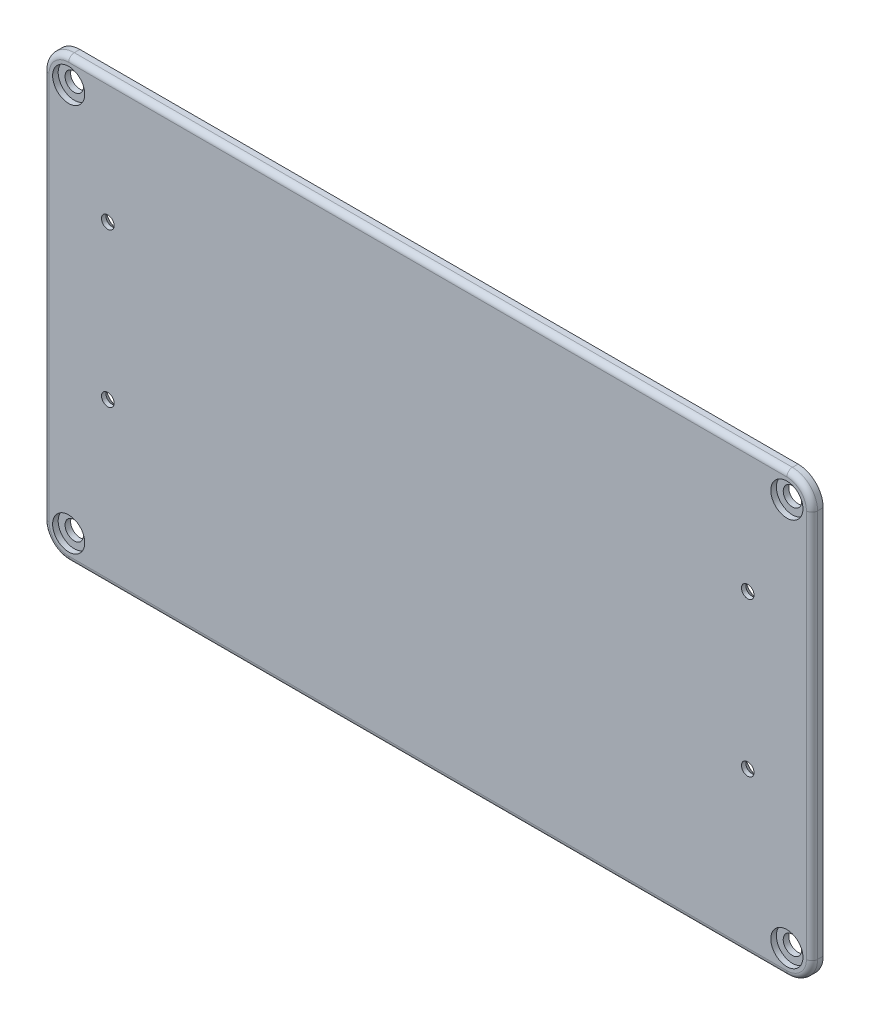
ISO-10303-21;
HEADER;
FILE_DESCRIPTION(('STEP AP214'),'2;1');
FILE_NAME('part.step','',(''),(''),'','','');
FILE_SCHEMA(('AUTOMOTIVE_DESIGN { 1 0 10303 214 1 1 1 1 }'));
ENDSEC;
DATA;
#1=APPLICATION_CONTEXT('core data for automotive mechanical design processes');
#2=APPLICATION_PROTOCOL_DEFINITION('international standard','automotive_design',2000,#1);
#3=PRODUCT_CONTEXT('',#1,'mechanical');
#4=PRODUCT('Part','Part','',(#3));
#5=PRODUCT_RELATED_PRODUCT_CATEGORY('part','',(#4));
#6=PRODUCT_DEFINITION_FORMATION('','',#4);
#7=PRODUCT_DEFINITION_CONTEXT('part definition',#1,'design');
#8=PRODUCT_DEFINITION('design','',#6,#7);
#9=PRODUCT_DEFINITION_SHAPE('','',#8);
#10=(LENGTH_UNIT() NAMED_UNIT(*) SI_UNIT(.MILLI.,.METRE.));
#11=(NAMED_UNIT(*) PLANE_ANGLE_UNIT() SI_UNIT($,.RADIAN.));
#12=(NAMED_UNIT(*) SI_UNIT($,.STERADIAN.) SOLID_ANGLE_UNIT());
#13=UNCERTAINTY_MEASURE_WITH_UNIT(LENGTH_MEASURE(1.E-05),#10,'distance_accuracy_value','');
#14=(GEOMETRIC_REPRESENTATION_CONTEXT(3) GLOBAL_UNCERTAINTY_ASSIGNED_CONTEXT((#13)) GLOBAL_UNIT_ASSIGNED_CONTEXT((#10,
#11,#12)) REPRESENTATION_CONTEXT('',''));
#15=CARTESIAN_POINT('',(0.,0.,0.));
#16=DIRECTION('',(0.,0.,1.));
#17=DIRECTION('',(1.,0.,0.));
#18=AXIS2_PLACEMENT_3D('',#15,#16,#17);
#19=CARTESIAN_POINT('',(-137.5,78.5,4.));
#20=DIRECTION('',(0.,-1.,0.));
#21=DIRECTION('',(0.,0.,-1.));
#22=AXIS2_PLACEMENT_3D('',#19,#20,#21);
#23=PLANE('',#22);
#24=DIRECTION('',(0.,0.,-1.));
#25=VECTOR('',#24,1.);
#26=CARTESIAN_POINT('',(-128.5,78.5,4.));
#27=LINE('',#26,#25);
#28=CARTESIAN_POINT('',(-128.5,78.5,0.));
#29=VERTEX_POINT('',#28);
#30=CARTESIAN_POINT('',(-128.5,78.5,2.));
#31=VERTEX_POINT('',#30);
#32=EDGE_CURVE('E141',#29,#31,#27,.F.);
#33=ORIENTED_EDGE('',*,*,#32,.T.);
#34=DIRECTION('',(-1.,0.,0.));
#35=VECTOR('',#34,1.);
#36=CARTESIAN_POINT('',(-137.5,78.5,2.));
#37=LINE('',#36,#35);
#38=CARTESIAN_POINT('',(128.5,78.5,2.));
#39=VERTEX_POINT('',#38);
#40=EDGE_CURVE('E137',#31,#39,#37,.F.);
#41=ORIENTED_EDGE('',*,*,#40,.T.);
#42=DIRECTION('',(0.,0.,-1.));
#43=VECTOR('',#42,1.);
#44=CARTESIAN_POINT('',(128.5,78.5,4.));
#45=LINE('',#44,#43);
#46=CARTESIAN_POINT('',(128.5,78.5,0.));
#47=VERTEX_POINT('',#46);
#48=EDGE_CURVE('E130',#39,#47,#45,.T.);
#49=ORIENTED_EDGE('',*,*,#48,.T.);
#50=DIRECTION('',(-1.,0.,0.));
#51=VECTOR('',#50,1.);
#52=CARTESIAN_POINT('',(-137.5,78.5,0.));
#53=LINE('',#52,#51);
#54=EDGE_CURVE('E134',#47,#29,#53,.T.);
#55=ORIENTED_EDGE('',*,*,#54,.T.);
#56=EDGE_LOOP('',(#33,#41,#49,#55));
#57=FACE_BOUND('',#56,.T.);
#58=ADVANCED_FACE('F39',(#57),#23,.F.);
#59=CARTESIAN_POINT('',(-137.5,78.5,4.));
#60=DIRECTION('',(1.,0.,0.));
#61=DIRECTION('',(0.,0.,-1.));
#62=AXIS2_PLACEMENT_3D('',#59,#60,#61);
#63=PLANE('',#62);
#64=DIRECTION('',(0.,0.,-1.));
#65=VECTOR('',#64,1.);
#66=CARTESIAN_POINT('',(-137.5,-69.5,4.));
#67=LINE('',#66,#65);
#68=CARTESIAN_POINT('',(-137.5,-69.5,0.));
#69=VERTEX_POINT('',#68);
#70=CARTESIAN_POINT('',(-137.5,-69.5,2.));
#71=VERTEX_POINT('',#70);
#72=EDGE_CURVE('E182',#69,#71,#67,.F.);
#73=ORIENTED_EDGE('',*,*,#72,.T.);
#74=DIRECTION('',(0.,-1.,0.));
#75=VECTOR('',#74,1.);
#76=CARTESIAN_POINT('',(-137.5,78.5,2.));
#77=LINE('',#76,#75);
#78=CARTESIAN_POINT('',(-137.5,69.5,2.));
#79=VERTEX_POINT('',#78);
#80=EDGE_CURVE('E207',#71,#79,#77,.F.);
#81=ORIENTED_EDGE('',*,*,#80,.T.);
#82=DIRECTION('',(0.,0.,-1.));
#83=VECTOR('',#82,1.);
#84=CARTESIAN_POINT('',(-137.5,69.5,4.));
#85=LINE('',#84,#83);
#86=CARTESIAN_POINT('',(-137.5,69.5,0.));
#87=VERTEX_POINT('',#86);
#88=EDGE_CURVE('E185',#79,#87,#85,.T.);
#89=ORIENTED_EDGE('',*,*,#88,.T.);
#90=DIRECTION('',(0.,-1.,0.));
#91=VECTOR('',#90,1.);
#92=CARTESIAN_POINT('',(-137.5,78.5,0.));
#93=LINE('',#92,#91);
#94=EDGE_CURVE('E157',#87,#69,#93,.T.);
#95=ORIENTED_EDGE('',*,*,#94,.T.);
#96=EDGE_LOOP('',(#73,#81,#89,#95));
#97=FACE_BOUND('',#96,.T.);
#98=ADVANCED_FACE('F349',(#97),#63,.F.);
#99=CARTESIAN_POINT('',(-137.5,-78.5,4.));
#100=DIRECTION('',(0.,1.,0.));
#101=DIRECTION('',(0.,0.,1.));
#102=AXIS2_PLACEMENT_3D('',#99,#100,#101);
#103=PLANE('',#102);
#104=DIRECTION('',(0.,0.,-1.));
#105=VECTOR('',#104,1.);
#106=CARTESIAN_POINT('',(128.5,-78.5,4.));
#107=LINE('',#106,#105);
#108=CARTESIAN_POINT('',(128.5,-78.5,0.));
#109=VERTEX_POINT('',#108);
#110=CARTESIAN_POINT('',(128.5,-78.5,2.));
#111=VERTEX_POINT('',#110);
#112=EDGE_CURVE('E180',#109,#111,#107,.F.);
#113=ORIENTED_EDGE('',*,*,#112,.T.);
#114=DIRECTION('',(1.,0.,0.));
#115=VECTOR('',#114,1.);
#116=CARTESIAN_POINT('',(-137.5,-78.5,2.));
#117=LINE('',#116,#115);
#118=CARTESIAN_POINT('',(-128.5,-78.5,2.));
#119=VERTEX_POINT('',#118);
#120=EDGE_CURVE('E11',#111,#119,#117,.F.);
#121=ORIENTED_EDGE('',*,*,#120,.T.);
#122=DIRECTION('',(0.,0.,-1.));
#123=VECTOR('',#122,1.);
#124=CARTESIAN_POINT('',(-128.5,-78.5,4.));
#125=LINE('',#124,#123);
#126=CARTESIAN_POINT('',(-128.5,-78.5,0.));
#127=VERTEX_POINT('',#126);
#128=EDGE_CURVE('E178',#119,#127,#125,.T.);
#129=ORIENTED_EDGE('',*,*,#128,.T.);
#130=DIRECTION('',(1.,0.,0.));
#131=VECTOR('',#130,1.);
#132=CARTESIAN_POINT('',(-137.5,-78.5,0.));
#133=LINE('',#132,#131);
#134=EDGE_CURVE('E161',#127,#109,#133,.T.);
#135=ORIENTED_EDGE('',*,*,#134,.T.);
#136=EDGE_LOOP('',(#113,#121,#129,#135));
#137=FACE_BOUND('',#136,.T.);
#138=ADVANCED_FACE('F354',(#137),#103,.F.);
#139=CARTESIAN_POINT('',(137.5,78.5,4.));
#140=DIRECTION('',(-1.,0.,0.));
#141=DIRECTION('',(0.,0.,1.));
#142=AXIS2_PLACEMENT_3D('',#139,#140,#141);
#143=PLANE('',#142);
#144=DIRECTION('',(0.,0.,-1.));
#145=VECTOR('',#144,1.);
#146=CARTESIAN_POINT('',(137.5,69.5,4.));
#147=LINE('',#146,#145);
#148=CARTESIAN_POINT('',(137.5,69.5,0.));
#149=VERTEX_POINT('',#148);
#150=CARTESIAN_POINT('',(137.5,69.5,2.));
#151=VERTEX_POINT('',#150);
#152=EDGE_CURVE('E146',#149,#151,#147,.F.);
#153=ORIENTED_EDGE('',*,*,#152,.T.);
#154=DIRECTION('',(0.,1.,0.));
#155=VECTOR('',#154,1.);
#156=CARTESIAN_POINT('',(137.5,78.5,2.));
#157=LINE('',#156,#155);
#158=CARTESIAN_POINT('',(137.5,-69.5,2.));
#159=VERTEX_POINT('',#158);
#160=EDGE_CURVE('E63',#151,#159,#157,.F.);
#161=ORIENTED_EDGE('',*,*,#160,.T.);
#162=DIRECTION('',(0.,0.,-1.));
#163=VECTOR('',#162,1.);
#164=CARTESIAN_POINT('',(137.5,-69.5,4.));
#165=LINE('',#164,#163);
#166=CARTESIAN_POINT('',(137.5,-69.5,0.));
#167=VERTEX_POINT('',#166);
#168=EDGE_CURVE('E150',#159,#167,#165,.T.);
#169=ORIENTED_EDGE('',*,*,#168,.T.);
#170=DIRECTION('',(0.,1.,0.));
#171=VECTOR('',#170,1.);
#172=CARTESIAN_POINT('',(137.5,78.5,0.));
#173=LINE('',#172,#171);
#174=EDGE_CURVE('E170',#167,#149,#173,.T.);
#175=ORIENTED_EDGE('',*,*,#174,.T.);
#176=EDGE_LOOP('',(#153,#161,#169,#175));
#177=FACE_BOUND('',#176,.T.);
#178=ADVANCED_FACE('F344',(#177),#143,.F.);
#179=CARTESIAN_POINT('',(0.,0.,4.));
#180=DIRECTION('',(0.,0.,-1.));
#181=DIRECTION('',(-1.,0.,0.));
#182=AXIS2_PLACEMENT_3D('',#179,#180,#181);
#183=PLANE('',#182);
#184=DIRECTION('',(0.,-1.,0.));
#185=VECTOR('',#184,1.);
#186=CARTESIAN_POINT('',(-135.5,0.,4.));
#187=LINE('',#186,#185);
#188=CARTESIAN_POINT('',(-135.5,69.5,4.));
#189=VERTEX_POINT('',#188);
#190=CARTESIAN_POINT('',(-135.5,-69.5,4.));
#191=VERTEX_POINT('',#190);
#192=EDGE_CURVE('E199',#189,#191,#187,.T.);
#193=ORIENTED_EDGE('',*,*,#192,.T.);
#194=CARTESIAN_POINT('',(-128.5,-69.5,4.));
#195=DIRECTION('',(0.,0.,-1.));
#196=DIRECTION('',(-1.,0.,0.));
#197=AXIS2_PLACEMENT_3D('',#194,#195,#196);
#198=CIRCLE('',#197,7.);
#199=CARTESIAN_POINT('',(-128.5,-76.5,4.));
#200=VERTEX_POINT('',#199);
#201=EDGE_CURVE('E201',#191,#200,#198,.F.);
#202=ORIENTED_EDGE('',*,*,#201,.T.);
#203=DIRECTION('',(1.,0.,0.));
#204=VECTOR('',#203,1.);
#205=CARTESIAN_POINT('',(0.,-76.5,4.));
#206=LINE('',#205,#204);
#207=CARTESIAN_POINT('',(128.5,-76.5,4.));
#208=VERTEX_POINT('',#207);
#209=EDGE_CURVE('E187',#200,#208,#206,.T.);
#210=ORIENTED_EDGE('',*,*,#209,.T.);
#211=CARTESIAN_POINT('',(128.5,-69.5,4.));
#212=DIRECTION('',(0.,0.,-1.));
#213=DIRECTION('',(-1.,0.,0.));
#214=AXIS2_PLACEMENT_3D('',#211,#212,#213);
#215=CIRCLE('',#214,7.);
#216=CARTESIAN_POINT('',(135.5,-69.5,4.));
#217=VERTEX_POINT('',#216);
#218=EDGE_CURVE('E189',#208,#217,#215,.F.);
#219=ORIENTED_EDGE('',*,*,#218,.T.);
#220=DIRECTION('',(0.,1.,0.));
#221=VECTOR('',#220,1.);
#222=CARTESIAN_POINT('',(135.5,0.,4.));
#223=LINE('',#222,#221);
#224=CARTESIAN_POINT('',(135.5,69.5,4.));
#225=VERTEX_POINT('',#224);
#226=EDGE_CURVE('E191',#217,#225,#223,.T.);
#227=ORIENTED_EDGE('',*,*,#226,.T.);
#228=CARTESIAN_POINT('',(128.5,69.5,4.));
#229=DIRECTION('',(0.,0.,-1.));
#230=DIRECTION('',(-1.,0.,0.));
#231=AXIS2_PLACEMENT_3D('',#228,#229,#230);
#232=CIRCLE('',#231,7.);
#233=CARTESIAN_POINT('',(128.5,76.5,4.));
#234=VERTEX_POINT('',#233);
#235=EDGE_CURVE('E193',#225,#234,#232,.F.);
#236=ORIENTED_EDGE('',*,*,#235,.T.);
#237=DIRECTION('',(-1.,0.,0.));
#238=VECTOR('',#237,1.);
#239=CARTESIAN_POINT('',(0.,76.5,4.));
#240=LINE('',#239,#238);
#241=CARTESIAN_POINT('',(-128.5,76.5,4.));
#242=VERTEX_POINT('',#241);
#243=EDGE_CURVE('E195',#234,#242,#240,.T.);
#244=ORIENTED_EDGE('',*,*,#243,.T.);
#245=CARTESIAN_POINT('',(-128.5,69.5,4.));
#246=DIRECTION('',(0.,0.,-1.));
#247=DIRECTION('',(-1.,0.,0.));
#248=AXIS2_PLACEMENT_3D('',#245,#246,#247);
#249=CIRCLE('',#248,7.);
#250=EDGE_CURVE('E197',#242,#189,#249,.F.);
#251=ORIENTED_EDGE('',*,*,#250,.T.);
#252=EDGE_LOOP('',(#193,#202,#210,#219,#227,#236,#244,#251));
#253=FACE_BOUND('',#252,.T.);
#254=CARTESIAN_POINT('',(-128.5,-69.5,4.));
#255=DIRECTION('',(0.,0.,1.));
#256=DIRECTION('',(1.,0.,0.));
#257=AXIS2_PLACEMENT_3D('',#254,#255,#256);
#258=CIRCLE('',#257,5.75000000000001);
#259=CARTESIAN_POINT('',(-122.75,-69.5,4.));
#260=VERTEX_POINT('',#259);
#261=EDGE_CURVE('E237',#260,#260,#258,.T.);
#262=ORIENTED_EDGE('',*,*,#261,.F.);
#263=EDGE_LOOP('',(#262));
#264=FACE_BOUND('',#263,.T.);
#265=CARTESIAN_POINT('',(-128.5,69.5,4.));
#266=DIRECTION('',(0.,0.,1.));
#267=DIRECTION('',(1.,0.,0.));
#268=AXIS2_PLACEMENT_3D('',#265,#266,#267);
#269=CIRCLE('',#268,5.75000000000001);
#270=CARTESIAN_POINT('',(-122.75,69.5,4.));
#271=VERTEX_POINT('',#270);
#272=EDGE_CURVE('E255',#271,#271,#269,.T.);
#273=ORIENTED_EDGE('',*,*,#272,.F.);
#274=EDGE_LOOP('',(#273));
#275=FACE_BOUND('',#274,.T.);
#276=CARTESIAN_POINT('',(128.5,69.5,4.));
#277=DIRECTION('',(0.,0.,1.));
#278=DIRECTION('',(1.,0.,0.));
#279=AXIS2_PLACEMENT_3D('',#276,#277,#278);
#280=CIRCLE('',#279,5.75000000000001);
#281=CARTESIAN_POINT('',(134.25,69.5,4.));
#282=VERTEX_POINT('',#281);
#283=EDGE_CURVE('E267',#282,#282,#280,.T.);
#284=ORIENTED_EDGE('',*,*,#283,.F.);
#285=EDGE_LOOP('',(#284));
#286=FACE_BOUND('',#285,.T.);
#287=CARTESIAN_POINT('',(128.5,-69.5,4.));
#288=DIRECTION('',(0.,0.,1.));
#289=DIRECTION('',(1.,0.,0.));
#290=AXIS2_PLACEMENT_3D('',#287,#288,#289);
#291=CIRCLE('',#290,5.75000000000001);
#292=CARTESIAN_POINT('',(134.25,-69.5,4.));
#293=VERTEX_POINT('',#292);
#294=EDGE_CURVE('E279',#293,#293,#291,.T.);
#295=ORIENTED_EDGE('',*,*,#294,.F.);
#296=EDGE_LOOP('',(#295));
#297=FACE_BOUND('',#296,.T.);
#298=CARTESIAN_POINT('',(114.5,34.,4.));
#299=DIRECTION('',(0.,0.,-1.));
#300=DIRECTION('',(-1.,0.,0.));
#301=AXIS2_PLACEMENT_3D('',#298,#299,#300);
#302=CIRCLE('',#301,2.25);
#303=CARTESIAN_POINT('',(112.25,34.,4.));
#304=VERTEX_POINT('',#303);
#305=EDGE_CURVE('E297',#304,#304,#302,.T.);
#306=ORIENTED_EDGE('',*,*,#305,.T.);
#307=EDGE_LOOP('',(#306));
#308=FACE_BOUND('',#307,.T.);
#309=CARTESIAN_POINT('',(114.5,-21.,4.));
#310=DIRECTION('',(0.,0.,-1.));
#311=DIRECTION('',(-1.,0.,0.));
#312=AXIS2_PLACEMENT_3D('',#309,#310,#311);
#313=CIRCLE('',#312,2.25);
#314=CARTESIAN_POINT('',(112.25,-21.,4.));
#315=VERTEX_POINT('',#314);
#316=EDGE_CURVE('E306',#315,#315,#313,.T.);
#317=ORIENTED_EDGE('',*,*,#316,.T.);
#318=EDGE_LOOP('',(#317));
#319=FACE_BOUND('',#318,.T.);
#320=CARTESIAN_POINT('',(-114.5,34.,4.));
#321=DIRECTION('',(0.,0.,-1.));
#322=DIRECTION('',(-1.,0.,0.));
#323=AXIS2_PLACEMENT_3D('',#320,#321,#322);
#324=CIRCLE('',#323,2.25);
#325=CARTESIAN_POINT('',(-116.75,34.,4.));
#326=VERTEX_POINT('',#325);
#327=EDGE_CURVE('E315',#326,#326,#324,.T.);
#328=ORIENTED_EDGE('',*,*,#327,.T.);
#329=EDGE_LOOP('',(#328));
#330=FACE_BOUND('',#329,.T.);
#331=CARTESIAN_POINT('',(-114.5,-21.,4.));
#332=DIRECTION('',(0.,0.,-1.));
#333=DIRECTION('',(-1.,0.,0.));
#334=AXIS2_PLACEMENT_3D('',#331,#332,#333);
#335=CIRCLE('',#334,2.25);
#336=CARTESIAN_POINT('',(-116.75,-21.,4.));
#337=VERTEX_POINT('',#336);
#338=EDGE_CURVE('E158',#337,#337,#335,.T.);
#339=ORIENTED_EDGE('',*,*,#338,.T.);
#340=EDGE_LOOP('',(#339));
#341=FACE_BOUND('',#340,.T.);
#342=ADVANCED_FACE('F333',(#253,#264,#275,#286,#297,#308,#319,#330,#341),#183,.F.);
#343=CARTESIAN_POINT('',(0.,0.,0.));
#344=DIRECTION('',(0.,0.,-1.));
#345=DIRECTION('',(-1.,0.,0.));
#346=AXIS2_PLACEMENT_3D('',#343,#344,#345);
#347=PLANE('',#346);
#348=CARTESIAN_POINT('',(-128.5,-69.5,0.));
#349=DIRECTION('',(0.,0.,1.));
#350=DIRECTION('',(1.,0.,0.));
#351=AXIS2_PLACEMENT_3D('',#348,#349,#350);
#352=CIRCLE('',#351,3.3);
#353=CARTESIAN_POINT('',(-125.2,-69.5,0.));
#354=VERTEX_POINT('',#353);
#355=EDGE_CURVE('E252',#354,#354,#352,.T.);
#356=ORIENTED_EDGE('',*,*,#355,.T.);
#357=EDGE_LOOP('',(#356));
#358=FACE_BOUND('',#357,.T.);
#359=CARTESIAN_POINT('',(-128.5,69.5,0.));
#360=DIRECTION('',(0.,0.,1.));
#361=DIRECTION('',(1.,0.,0.));
#362=AXIS2_PLACEMENT_3D('',#359,#360,#361);
#363=CIRCLE('',#362,3.3);
#364=CARTESIAN_POINT('',(-125.2,69.5,0.));
#365=VERTEX_POINT('',#364);
#366=EDGE_CURVE('E264',#365,#365,#363,.T.);
#367=ORIENTED_EDGE('',*,*,#366,.T.);
#368=EDGE_LOOP('',(#367));
#369=FACE_BOUND('',#368,.T.);
#370=CARTESIAN_POINT('',(128.5,69.5,0.));
#371=DIRECTION('',(0.,0.,1.));
#372=DIRECTION('',(1.,0.,0.));
#373=AXIS2_PLACEMENT_3D('',#370,#371,#372);
#374=CIRCLE('',#373,3.3);
#375=CARTESIAN_POINT('',(131.8,69.5,0.));
#376=VERTEX_POINT('',#375);
#377=EDGE_CURVE('E276',#376,#376,#374,.T.);
#378=ORIENTED_EDGE('',*,*,#377,.T.);
#379=EDGE_LOOP('',(#378));
#380=FACE_BOUND('',#379,.T.);
#381=CARTESIAN_POINT('',(128.5,-69.5,0.));
#382=DIRECTION('',(0.,0.,1.));
#383=DIRECTION('',(1.,0.,0.));
#384=AXIS2_PLACEMENT_3D('',#381,#382,#383);
#385=CIRCLE('',#384,3.3);
#386=CARTESIAN_POINT('',(131.8,-69.5,0.));
#387=VERTEX_POINT('',#386);
#388=EDGE_CURVE('E288',#387,#387,#385,.T.);
#389=ORIENTED_EDGE('',*,*,#388,.T.);
#390=EDGE_LOOP('',(#389));
#391=FACE_BOUND('',#390,.T.);
#392=CARTESIAN_POINT('',(114.5,34.,0.));
#393=DIRECTION('',(0.,0.,-1.));
#394=DIRECTION('',(-1.,0.,0.));
#395=AXIS2_PLACEMENT_3D('',#392,#393,#394);
#396=CIRCLE('',#395,4.7);
#397=CARTESIAN_POINT('',(109.8,34.,0.));
#398=VERTEX_POINT('',#397);
#399=EDGE_CURVE('E291',#398,#398,#396,.T.);
#400=ORIENTED_EDGE('',*,*,#399,.F.);
#401=EDGE_LOOP('',(#400));
#402=FACE_BOUND('',#401,.T.);
#403=CARTESIAN_POINT('',(114.5,-21.,0.));
#404=DIRECTION('',(0.,0.,-1.));
#405=DIRECTION('',(-1.,0.,0.));
#406=AXIS2_PLACEMENT_3D('',#403,#404,#405);
#407=CIRCLE('',#406,4.7);
#408=CARTESIAN_POINT('',(109.8,-21.,0.));
#409=VERTEX_POINT('',#408);
#410=EDGE_CURVE('E300',#409,#409,#407,.T.);
#411=ORIENTED_EDGE('',*,*,#410,.F.);
#412=EDGE_LOOP('',(#411));
#413=FACE_BOUND('',#412,.T.);
#414=CARTESIAN_POINT('',(-114.5,34.,0.));
#415=DIRECTION('',(0.,0.,-1.));
#416=DIRECTION('',(-1.,0.,0.));
#417=AXIS2_PLACEMENT_3D('',#414,#415,#416);
#418=CIRCLE('',#417,4.7);
#419=CARTESIAN_POINT('',(-119.2,34.,0.));
#420=VERTEX_POINT('',#419);
#421=EDGE_CURVE('E309',#420,#420,#418,.T.);
#422=ORIENTED_EDGE('',*,*,#421,.F.);
#423=EDGE_LOOP('',(#422));
#424=FACE_BOUND('',#423,.T.);
#425=CARTESIAN_POINT('',(-114.5,-21.,0.));
#426=DIRECTION('',(0.,0.,-1.));
#427=DIRECTION('',(-1.,0.,0.));
#428=AXIS2_PLACEMENT_3D('',#425,#426,#427);
#429=CIRCLE('',#428,4.7);
#430=CARTESIAN_POINT('',(-119.2,-21.,0.));
#431=VERTEX_POINT('',#430);
#432=EDGE_CURVE('E318',#431,#431,#429,.T.);
#433=ORIENTED_EDGE('',*,*,#432,.F.);
#434=EDGE_LOOP('',(#433));
#435=FACE_BOUND('',#434,.T.);
#436=ORIENTED_EDGE('',*,*,#54,.F.);
#437=CARTESIAN_POINT('',(128.5,69.5,0.));
#438=DIRECTION('',(0.,0.,-1.));
#439=DIRECTION('',(-1.,0.,0.));
#440=AXIS2_PLACEMENT_3D('',#437,#438,#439);
#441=CIRCLE('',#440,9.);
#442=EDGE_CURVE('E144',#47,#149,#441,.T.);
#443=ORIENTED_EDGE('',*,*,#442,.T.);
#444=ORIENTED_EDGE('',*,*,#174,.F.);
#445=CARTESIAN_POINT('',(128.5,-69.5,0.));
#446=DIRECTION('',(0.,0.,-1.));
#447=DIRECTION('',(-1.,0.,0.));
#448=AXIS2_PLACEMENT_3D('',#445,#446,#447);
#449=CIRCLE('',#448,9.);
#450=EDGE_CURVE('E151',#167,#109,#449,.T.);
#451=ORIENTED_EDGE('',*,*,#450,.T.);
#452=ORIENTED_EDGE('',*,*,#134,.F.);
#453=CARTESIAN_POINT('',(-128.5,-69.5,0.));
#454=DIRECTION('',(0.,0.,-1.));
#455=DIRECTION('',(-1.,0.,0.));
#456=AXIS2_PLACEMENT_3D('',#453,#454,#455);
#457=CIRCLE('',#456,9.);
#458=EDGE_CURVE('E140',#127,#69,#457,.T.);
#459=ORIENTED_EDGE('',*,*,#458,.T.);
#460=ORIENTED_EDGE('',*,*,#94,.F.);
#461=CARTESIAN_POINT('',(-128.5,69.5,0.));
#462=DIRECTION('',(0.,0.,-1.));
#463=DIRECTION('',(-1.,0.,0.));
#464=AXIS2_PLACEMENT_3D('',#461,#462,#463);
#465=CIRCLE('',#464,9.);
#466=EDGE_CURVE('E156',#87,#29,#465,.T.);
#467=ORIENTED_EDGE('',*,*,#466,.T.);
#468=EDGE_LOOP('',(#436,#443,#444,#451,#452,#459,#460,#467));
#469=FACE_BOUND('',#468,.T.);
#470=ADVANCED_FACE('F153',(#358,#369,#380,#391,#402,#413,#424,#435,#469),#347,.T.);
#471=CARTESIAN_POINT('',(-114.5,-21.,0.));
#472=DIRECTION('',(0.,0.,-1.));
#473=DIRECTION('',(-1.,0.,0.));
#474=AXIS2_PLACEMENT_3D('',#471,#472,#473);
#475=CYLINDRICAL_SURFACE('',#474,2.25);
#476=ORIENTED_EDGE('',*,*,#338,.F.);
#477=EDGE_LOOP('',(#476));
#478=FACE_BOUND('',#477,.T.);
#479=CARTESIAN_POINT('',(-114.5,-21.,2.45));
#480=DIRECTION('',(0.,0.,-1.));
#481=DIRECTION('',(-1.,0.,0.));
#482=AXIS2_PLACEMENT_3D('',#479,#480,#481);
#483=CIRCLE('',#482,2.25);
#484=CARTESIAN_POINT('',(-116.75,-21.,2.45));
#485=VERTEX_POINT('',#484);
#486=EDGE_CURVE('E164',#485,#485,#483,.T.);
#487=ORIENTED_EDGE('',*,*,#486,.T.);
#488=EDGE_LOOP('',(#487));
#489=FACE_BOUND('',#488,.T.);
#490=ADVANCED_FACE('F323',(#478,#489),#475,.F.);
#491=CARTESIAN_POINT('',(-114.5,-21.,0.));
#492=DIRECTION('',(0.,0.,-1.));
#493=DIRECTION('',(-1.,0.,0.));
#494=AXIS2_PLACEMENT_3D('',#491,#492,#493);
#495=CONICAL_SURFACE('',#494,4.7,0.785398163397447);
#496=ORIENTED_EDGE('',*,*,#486,.F.);
#497=EDGE_LOOP('',(#496));
#498=FACE_BOUND('',#497,.T.);
#499=ORIENTED_EDGE('',*,*,#432,.T.);
#500=EDGE_LOOP('',(#499));
#501=FACE_BOUND('',#500,.T.);
#502=ADVANCED_FACE('F325',(#498,#501),#495,.F.);
#503=CARTESIAN_POINT('',(-114.5,34.,0.));
#504=DIRECTION('',(0.,0.,-1.));
#505=DIRECTION('',(-1.,0.,0.));
#506=AXIS2_PLACEMENT_3D('',#503,#504,#505);
#507=CYLINDRICAL_SURFACE('',#506,2.25);
#508=ORIENTED_EDGE('',*,*,#327,.F.);
#509=EDGE_LOOP('',(#508));
#510=FACE_BOUND('',#509,.T.);
#511=CARTESIAN_POINT('',(-114.5,34.,2.45));
#512=DIRECTION('',(0.,0.,-1.));
#513=DIRECTION('',(-1.,0.,0.));
#514=AXIS2_PLACEMENT_3D('',#511,#512,#513);
#515=CIRCLE('',#514,2.25);
#516=CARTESIAN_POINT('',(-116.75,34.,2.45));
#517=VERTEX_POINT('',#516);
#518=EDGE_CURVE('E312',#517,#517,#515,.T.);
#519=ORIENTED_EDGE('',*,*,#518,.T.);
#520=EDGE_LOOP('',(#519));
#521=FACE_BOUND('',#520,.T.);
#522=ADVANCED_FACE('F328',(#510,#521),#507,.F.);
#523=CARTESIAN_POINT('',(-114.5,34.,0.));
#524=DIRECTION('',(0.,0.,-1.));
#525=DIRECTION('',(-1.,0.,0.));
#526=AXIS2_PLACEMENT_3D('',#523,#524,#525);
#527=CONICAL_SURFACE('',#526,4.7,0.785398163397447);
#528=ORIENTED_EDGE('',*,*,#518,.F.);
#529=EDGE_LOOP('',(#528));
#530=FACE_BOUND('',#529,.T.);
#531=ORIENTED_EDGE('',*,*,#421,.T.);
#532=EDGE_LOOP('',(#531));
#533=FACE_BOUND('',#532,.T.);
#534=ADVANCED_FACE('F443',(#530,#533),#527,.F.);
#535=CARTESIAN_POINT('',(114.5,-21.,0.));
#536=DIRECTION('',(0.,0.,-1.));
#537=DIRECTION('',(-1.,0.,0.));
#538=AXIS2_PLACEMENT_3D('',#535,#536,#537);
#539=CYLINDRICAL_SURFACE('',#538,2.25);
#540=ORIENTED_EDGE('',*,*,#316,.F.);
#541=EDGE_LOOP('',(#540));
#542=FACE_BOUND('',#541,.T.);
#543=CARTESIAN_POINT('',(114.5,-21.,2.45));
#544=DIRECTION('',(0.,0.,-1.));
#545=DIRECTION('',(-1.,0.,0.));
#546=AXIS2_PLACEMENT_3D('',#543,#544,#545);
#547=CIRCLE('',#546,2.25);
#548=CARTESIAN_POINT('',(112.25,-21.,2.45));
#549=VERTEX_POINT('',#548);
#550=EDGE_CURVE('E303',#549,#549,#547,.T.);
#551=ORIENTED_EDGE('',*,*,#550,.T.);
#552=EDGE_LOOP('',(#551));
#553=FACE_BOUND('',#552,.T.);
#554=ADVANCED_FACE('F449',(#542,#553),#539,.F.);
#555=CARTESIAN_POINT('',(114.5,-21.,0.));
#556=DIRECTION('',(0.,0.,-1.));
#557=DIRECTION('',(-1.,0.,0.));
#558=AXIS2_PLACEMENT_3D('',#555,#556,#557);
#559=CONICAL_SURFACE('',#558,4.7,0.785398163397447);
#560=ORIENTED_EDGE('',*,*,#550,.F.);
#561=EDGE_LOOP('',(#560));
#562=FACE_BOUND('',#561,.T.);
#563=ORIENTED_EDGE('',*,*,#410,.T.);
#564=EDGE_LOOP('',(#563));
#565=FACE_BOUND('',#564,.T.);
#566=ADVANCED_FACE('F456',(#562,#565),#559,.F.);
#567=CARTESIAN_POINT('',(114.5,34.,0.));
#568=DIRECTION('',(0.,0.,-1.));
#569=DIRECTION('',(-1.,0.,0.));
#570=AXIS2_PLACEMENT_3D('',#567,#568,#569);
#571=CYLINDRICAL_SURFACE('',#570,2.25);
#572=ORIENTED_EDGE('',*,*,#305,.F.);
#573=EDGE_LOOP('',(#572));
#574=FACE_BOUND('',#573,.T.);
#575=CARTESIAN_POINT('',(114.5,34.,2.45));
#576=DIRECTION('',(0.,0.,-1.));
#577=DIRECTION('',(-1.,0.,0.));
#578=AXIS2_PLACEMENT_3D('',#575,#576,#577);
#579=CIRCLE('',#578,2.25);
#580=CARTESIAN_POINT('',(112.25,34.,2.45));
#581=VERTEX_POINT('',#580);
#582=EDGE_CURVE('E294',#581,#581,#579,.T.);
#583=ORIENTED_EDGE('',*,*,#582,.T.);
#584=EDGE_LOOP('',(#583));
#585=FACE_BOUND('',#584,.T.);
#586=ADVANCED_FACE('F462',(#574,#585),#571,.F.);
#587=CARTESIAN_POINT('',(114.5,34.,0.));
#588=DIRECTION('',(0.,0.,-1.));
#589=DIRECTION('',(-1.,0.,0.));
#590=AXIS2_PLACEMENT_3D('',#587,#588,#589);
#591=CONICAL_SURFACE('',#590,4.7,0.785398163397447);
#592=ORIENTED_EDGE('',*,*,#582,.F.);
#593=EDGE_LOOP('',(#592));
#594=FACE_BOUND('',#593,.T.);
#595=ORIENTED_EDGE('',*,*,#399,.T.);
#596=EDGE_LOOP('',(#595));
#597=FACE_BOUND('',#596,.T.);
#598=ADVANCED_FACE('F466',(#594,#597),#591,.F.);
#599=CARTESIAN_POINT('',(128.5,-69.5,4.));
#600=DIRECTION('',(0.,0.,1.));
#601=DIRECTION('',(1.,0.,0.));
#602=AXIS2_PLACEMENT_3D('',#599,#600,#601);
#603=CYLINDRICAL_SURFACE('',#602,3.3);
#604=ORIENTED_EDGE('',*,*,#388,.F.);
#605=EDGE_LOOP('',(#604));
#606=FACE_BOUND('',#605,.T.);
#607=CARTESIAN_POINT('',(128.5,-69.5,2.));
#608=DIRECTION('',(0.,0.,1.));
#609=DIRECTION('',(1.,0.,0.));
#610=AXIS2_PLACEMENT_3D('',#607,#608,#609);
#611=CIRCLE('',#610,3.3);
#612=CARTESIAN_POINT('',(131.8,-69.5,2.));
#613=VERTEX_POINT('',#612);
#614=EDGE_CURVE('E285',#613,#613,#611,.T.);
#615=ORIENTED_EDGE('',*,*,#614,.T.);
#616=EDGE_LOOP('',(#615));
#617=FACE_BOUND('',#616,.T.);
#618=ADVANCED_FACE('F470',(#606,#617),#603,.F.);
#619=CARTESIAN_POINT('',(131.8,-69.5,2.));
#620=DIRECTION('',(0.,0.,-1.));
#621=DIRECTION('',(-1.,0.,0.));
#622=AXIS2_PLACEMENT_3D('',#619,#620,#621);
#623=PLANE('',#622);
#624=ORIENTED_EDGE('',*,*,#614,.F.);
#625=EDGE_LOOP('',(#624));
#626=FACE_BOUND('',#625,.T.);
#627=CARTESIAN_POINT('',(128.5,-69.5,2.));
#628=DIRECTION('',(0.,0.,1.));
#629=DIRECTION('',(1.,0.,0.));
#630=AXIS2_PLACEMENT_3D('',#627,#628,#629);
#631=CIRCLE('',#630,5.75000000000001);
#632=CARTESIAN_POINT('',(134.25,-69.5,2.));
#633=VERTEX_POINT('',#632);
#634=EDGE_CURVE('E282',#633,#633,#631,.T.);
#635=ORIENTED_EDGE('',*,*,#634,.T.);
#636=EDGE_LOOP('',(#635));
#637=FACE_BOUND('',#636,.T.);
#638=ADVANCED_FACE('F474',(#626,#637),#623,.F.);
#639=CARTESIAN_POINT('',(128.5,-69.5,4.));
#640=DIRECTION('',(0.,0.,1.));
#641=DIRECTION('',(1.,0.,0.));
#642=AXIS2_PLACEMENT_3D('',#639,#640,#641);
#643=CYLINDRICAL_SURFACE('',#642,5.75000000000001);
#644=ORIENTED_EDGE('',*,*,#634,.F.);
#645=EDGE_LOOP('',(#644));
#646=FACE_BOUND('',#645,.T.);
#647=ORIENTED_EDGE('',*,*,#294,.T.);
#648=EDGE_LOOP('',(#647));
#649=FACE_BOUND('',#648,.T.);
#650=ADVANCED_FACE('F478',(#646,#649),#643,.F.);
#651=CARTESIAN_POINT('',(128.5,69.5,4.));
#652=DIRECTION('',(0.,0.,1.));
#653=DIRECTION('',(1.,0.,0.));
#654=AXIS2_PLACEMENT_3D('',#651,#652,#653);
#655=CYLINDRICAL_SURFACE('',#654,3.3);
#656=ORIENTED_EDGE('',*,*,#377,.F.);
#657=EDGE_LOOP('',(#656));
#658=FACE_BOUND('',#657,.T.);
#659=CARTESIAN_POINT('',(128.5,69.5,2.));
#660=DIRECTION('',(0.,0.,1.));
#661=DIRECTION('',(1.,0.,0.));
#662=AXIS2_PLACEMENT_3D('',#659,#660,#661);
#663=CIRCLE('',#662,3.3);
#664=CARTESIAN_POINT('',(131.8,69.5,2.));
#665=VERTEX_POINT('',#664);
#666=EDGE_CURVE('E273',#665,#665,#663,.T.);
#667=ORIENTED_EDGE('',*,*,#666,.T.);
#668=EDGE_LOOP('',(#667));
#669=FACE_BOUND('',#668,.T.);
#670=ADVANCED_FACE('F482',(#658,#669),#655,.F.);
#671=CARTESIAN_POINT('',(131.8,69.5,2.));
#672=DIRECTION('',(0.,0.,-1.));
#673=DIRECTION('',(-1.,0.,0.));
#674=AXIS2_PLACEMENT_3D('',#671,#672,#673);
#675=PLANE('',#674);
#676=ORIENTED_EDGE('',*,*,#666,.F.);
#677=EDGE_LOOP('',(#676));
#678=FACE_BOUND('',#677,.T.);
#679=CARTESIAN_POINT('',(128.5,69.5,2.));
#680=DIRECTION('',(0.,0.,1.));
#681=DIRECTION('',(1.,0.,0.));
#682=AXIS2_PLACEMENT_3D('',#679,#680,#681);
#683=CIRCLE('',#682,5.75000000000001);
#684=CARTESIAN_POINT('',(134.25,69.5,2.));
#685=VERTEX_POINT('',#684);
#686=EDGE_CURVE('E270',#685,#685,#683,.T.);
#687=ORIENTED_EDGE('',*,*,#686,.T.);
#688=EDGE_LOOP('',(#687));
#689=FACE_BOUND('',#688,.T.);
#690=ADVANCED_FACE('F486',(#678,#689),#675,.F.);
#691=CARTESIAN_POINT('',(128.5,69.5,4.));
#692=DIRECTION('',(0.,0.,1.));
#693=DIRECTION('',(1.,0.,0.));
#694=AXIS2_PLACEMENT_3D('',#691,#692,#693);
#695=CYLINDRICAL_SURFACE('',#694,5.75000000000001);
#696=ORIENTED_EDGE('',*,*,#686,.F.);
#697=EDGE_LOOP('',(#696));
#698=FACE_BOUND('',#697,.T.);
#699=ORIENTED_EDGE('',*,*,#283,.T.);
#700=EDGE_LOOP('',(#699));
#701=FACE_BOUND('',#700,.T.);
#702=ADVANCED_FACE('F490',(#698,#701),#695,.F.);
#703=CARTESIAN_POINT('',(-128.5,69.5,4.));
#704=DIRECTION('',(0.,0.,1.));
#705=DIRECTION('',(1.,0.,0.));
#706=AXIS2_PLACEMENT_3D('',#703,#704,#705);
#707=CYLINDRICAL_SURFACE('',#706,3.3);
#708=ORIENTED_EDGE('',*,*,#366,.F.);
#709=EDGE_LOOP('',(#708));
#710=FACE_BOUND('',#709,.T.);
#711=CARTESIAN_POINT('',(-128.5,69.5,2.));
#712=DIRECTION('',(0.,0.,1.));
#713=DIRECTION('',(1.,0.,0.));
#714=AXIS2_PLACEMENT_3D('',#711,#712,#713);
#715=CIRCLE('',#714,3.3);
#716=CARTESIAN_POINT('',(-125.2,69.5,2.));
#717=VERTEX_POINT('',#716);
#718=EDGE_CURVE('E261',#717,#717,#715,.T.);
#719=ORIENTED_EDGE('',*,*,#718,.T.);
#720=EDGE_LOOP('',(#719));
#721=FACE_BOUND('',#720,.T.);
#722=ADVANCED_FACE('F494',(#710,#721),#707,.F.);
#723=CARTESIAN_POINT('',(-125.2,69.5,2.));
#724=DIRECTION('',(0.,0.,-1.));
#725=DIRECTION('',(-1.,0.,0.));
#726=AXIS2_PLACEMENT_3D('',#723,#724,#725);
#727=PLANE('',#726);
#728=ORIENTED_EDGE('',*,*,#718,.F.);
#729=EDGE_LOOP('',(#728));
#730=FACE_BOUND('',#729,.T.);
#731=CARTESIAN_POINT('',(-128.5,69.5,2.));
#732=DIRECTION('',(0.,0.,1.));
#733=DIRECTION('',(1.,0.,0.));
#734=AXIS2_PLACEMENT_3D('',#731,#732,#733);
#735=CIRCLE('',#734,5.75000000000001);
#736=CARTESIAN_POINT('',(-122.75,69.5,2.));
#737=VERTEX_POINT('',#736);
#738=EDGE_CURVE('E258',#737,#737,#735,.T.);
#739=ORIENTED_EDGE('',*,*,#738,.T.);
#740=EDGE_LOOP('',(#739));
#741=FACE_BOUND('',#740,.T.);
#742=ADVANCED_FACE('F498',(#730,#741),#727,.F.);
#743=CARTESIAN_POINT('',(-128.5,69.5,4.));
#744=DIRECTION('',(0.,0.,1.));
#745=DIRECTION('',(1.,0.,0.));
#746=AXIS2_PLACEMENT_3D('',#743,#744,#745);
#747=CYLINDRICAL_SURFACE('',#746,5.75000000000001);
#748=ORIENTED_EDGE('',*,*,#738,.F.);
#749=EDGE_LOOP('',(#748));
#750=FACE_BOUND('',#749,.T.);
#751=ORIENTED_EDGE('',*,*,#272,.T.);
#752=EDGE_LOOP('',(#751));
#753=FACE_BOUND('',#752,.T.);
#754=ADVANCED_FACE('F502',(#750,#753),#747,.F.);
#755=CARTESIAN_POINT('',(-128.5,-69.5,4.));
#756=DIRECTION('',(0.,0.,1.));
#757=DIRECTION('',(1.,0.,0.));
#758=AXIS2_PLACEMENT_3D('',#755,#756,#757);
#759=CYLINDRICAL_SURFACE('',#758,3.3);
#760=ORIENTED_EDGE('',*,*,#355,.F.);
#761=EDGE_LOOP('',(#760));
#762=FACE_BOUND('',#761,.T.);
#763=CARTESIAN_POINT('',(-128.5,-69.5,2.));
#764=DIRECTION('',(0.,0.,1.));
#765=DIRECTION('',(1.,0.,0.));
#766=AXIS2_PLACEMENT_3D('',#763,#764,#765);
#767=CIRCLE('',#766,3.3);
#768=CARTESIAN_POINT('',(-125.2,-69.5,2.));
#769=VERTEX_POINT('',#768);
#770=EDGE_CURVE('E247',#769,#769,#767,.T.);
#771=ORIENTED_EDGE('',*,*,#770,.T.);
#772=EDGE_LOOP('',(#771));
#773=FACE_BOUND('',#772,.T.);
#774=ADVANCED_FACE('F506',(#762,#773),#759,.F.);
#775=CARTESIAN_POINT('',(-125.2,-69.5,2.));
#776=DIRECTION('',(0.,0.,-1.));
#777=DIRECTION('',(-1.,0.,0.));
#778=AXIS2_PLACEMENT_3D('',#775,#776,#777);
#779=PLANE('',#778);
#780=ORIENTED_EDGE('',*,*,#770,.F.);
#781=EDGE_LOOP('',(#780));
#782=FACE_BOUND('',#781,.T.);
#783=CARTESIAN_POINT('',(-128.5,-69.5,2.));
#784=DIRECTION('',(0.,0.,1.));
#785=DIRECTION('',(1.,0.,0.));
#786=AXIS2_PLACEMENT_3D('',#783,#784,#785);
#787=CIRCLE('',#786,5.75000000000001);
#788=CARTESIAN_POINT('',(-122.75,-69.5,2.));
#789=VERTEX_POINT('',#788);
#790=EDGE_CURVE('E242',#789,#789,#787,.T.);
#791=ORIENTED_EDGE('',*,*,#790,.T.);
#792=EDGE_LOOP('',(#791));
#793=FACE_BOUND('',#792,.T.);
#794=ADVANCED_FACE('F510',(#782,#793),#779,.F.);
#795=CARTESIAN_POINT('',(-128.5,-69.5,4.));
#796=DIRECTION('',(0.,0.,1.));
#797=DIRECTION('',(1.,0.,0.));
#798=AXIS2_PLACEMENT_3D('',#795,#796,#797);
#799=CYLINDRICAL_SURFACE('',#798,5.75000000000001);
#800=ORIENTED_EDGE('',*,*,#790,.F.);
#801=EDGE_LOOP('',(#800));
#802=FACE_BOUND('',#801,.T.);
#803=ORIENTED_EDGE('',*,*,#261,.T.);
#804=EDGE_LOOP('',(#803));
#805=FACE_BOUND('',#804,.T.);
#806=ADVANCED_FACE('F362',(#802,#805),#799,.F.);
#807=CARTESIAN_POINT('',(128.5,69.5,4.));
#808=DIRECTION('',(0.,0.,-1.));
#809=DIRECTION('',(-1.,0.,0.));
#810=AXIS2_PLACEMENT_3D('',#807,#808,#809);
#811=CYLINDRICAL_SURFACE('',#810,9.);
#812=ORIENTED_EDGE('',*,*,#48,.F.);
#813=CARTESIAN_POINT('',(128.5,69.5,2.));
#814=DIRECTION('',(0.,0.,-1.));
#815=DIRECTION('',(-1.,0.,0.));
#816=AXIS2_PLACEMENT_3D('',#813,#814,#815);
#817=CIRCLE('',#816,9.);
#818=EDGE_CURVE('E212',#39,#151,#817,.T.);
#819=ORIENTED_EDGE('',*,*,#818,.T.);
#820=ORIENTED_EDGE('',*,*,#152,.F.);
#821=ORIENTED_EDGE('',*,*,#442,.F.);
#822=EDGE_LOOP('',(#812,#819,#820,#821));
#823=FACE_BOUND('',#822,.T.);
#824=ADVANCED_FACE('F145',(#823),#811,.T.);
#825=CARTESIAN_POINT('',(128.5,-69.5,4.));
#826=DIRECTION('',(0.,0.,-1.));
#827=DIRECTION('',(-1.,0.,0.));
#828=AXIS2_PLACEMENT_3D('',#825,#826,#827);
#829=CYLINDRICAL_SURFACE('',#828,9.);
#830=ORIENTED_EDGE('',*,*,#168,.F.);
#831=CARTESIAN_POINT('',(128.5,-69.5,2.));
#832=DIRECTION('',(0.,0.,-1.));
#833=DIRECTION('',(-1.,0.,0.));
#834=AXIS2_PLACEMENT_3D('',#831,#832,#833);
#835=CIRCLE('',#834,9.);
#836=EDGE_CURVE('E48',#159,#111,#835,.T.);
#837=ORIENTED_EDGE('',*,*,#836,.T.);
#838=ORIENTED_EDGE('',*,*,#112,.F.);
#839=ORIENTED_EDGE('',*,*,#450,.F.);
#840=EDGE_LOOP('',(#830,#837,#838,#839));
#841=FACE_BOUND('',#840,.T.);
#842=ADVANCED_FACE('F361',(#841),#829,.T.);
#843=CARTESIAN_POINT('',(-128.5,69.5,4.));
#844=DIRECTION('',(0.,0.,-1.));
#845=DIRECTION('',(-1.,0.,0.));
#846=AXIS2_PLACEMENT_3D('',#843,#844,#845);
#847=CYLINDRICAL_SURFACE('',#846,9.);
#848=ORIENTED_EDGE('',*,*,#88,.F.);
#849=CARTESIAN_POINT('',(-128.5,69.5,2.));
#850=DIRECTION('',(0.,0.,-1.));
#851=DIRECTION('',(-1.,0.,0.));
#852=AXIS2_PLACEMENT_3D('',#849,#850,#851);
#853=CIRCLE('',#852,9.);
#854=EDGE_CURVE('E209',#79,#31,#853,.T.);
#855=ORIENTED_EDGE('',*,*,#854,.T.);
#856=ORIENTED_EDGE('',*,*,#32,.F.);
#857=ORIENTED_EDGE('',*,*,#466,.F.);
#858=EDGE_LOOP('',(#848,#855,#856,#857));
#859=FACE_BOUND('',#858,.T.);
#860=ADVANCED_FACE('F365',(#859),#847,.T.);
#861=CARTESIAN_POINT('',(-128.5,-69.5,4.));
#862=DIRECTION('',(0.,0.,-1.));
#863=DIRECTION('',(-1.,0.,0.));
#864=AXIS2_PLACEMENT_3D('',#861,#862,#863);
#865=CYLINDRICAL_SURFACE('',#864,9.);
#866=ORIENTED_EDGE('',*,*,#128,.F.);
#867=CARTESIAN_POINT('',(-128.5,-69.5,2.));
#868=DIRECTION('',(0.,0.,-1.));
#869=DIRECTION('',(-1.,0.,0.));
#870=AXIS2_PLACEMENT_3D('',#867,#868,#869);
#871=CIRCLE('',#870,9.);
#872=EDGE_CURVE('E204',#119,#71,#871,.T.);
#873=ORIENTED_EDGE('',*,*,#872,.T.);
#874=ORIENTED_EDGE('',*,*,#72,.F.);
#875=ORIENTED_EDGE('',*,*,#458,.F.);
#876=EDGE_LOOP('',(#866,#873,#874,#875));
#877=FACE_BOUND('',#876,.T.);
#878=ADVANCED_FACE('F368',(#877),#865,.T.);
#879=CARTESIAN_POINT('',(128.5,69.5,2.));
#880=DIRECTION('',(0.,0.,-1.));
#881=DIRECTION('',(-1.,0.,0.));
#882=AXIS2_PLACEMENT_3D('',#879,#880,#881);
#883=TOROIDAL_SURFACE('',#882,7.,2.);
#884=CARTESIAN_POINT('',(135.5,69.5,2.));
#885=DIRECTION('',(0.,-1.,0.));
#886=DIRECTION('',(0.,0.,-1.));
#887=AXIS2_PLACEMENT_3D('',#884,#885,#886);
#888=CIRCLE('',#887,2.);
#889=EDGE_CURVE('E231',#151,#225,#888,.T.);
#890=ORIENTED_EDGE('',*,*,#889,.F.);
#891=ORIENTED_EDGE('',*,*,#818,.F.);
#892=CARTESIAN_POINT('',(128.5,76.5,2.));
#893=DIRECTION('',(-1.,0.,0.));
#894=DIRECTION('',(0.,0.,1.));
#895=AXIS2_PLACEMENT_3D('',#892,#893,#894);
#896=CIRCLE('',#895,2.);
#897=EDGE_CURVE('E43',#234,#39,#896,.T.);
#898=ORIENTED_EDGE('',*,*,#897,.F.);
#899=ORIENTED_EDGE('',*,*,#235,.F.);
#900=EDGE_LOOP('',(#890,#891,#898,#899));
#901=FACE_BOUND('',#900,.T.);
#902=ADVANCED_FACE('F41',(#901),#883,.T.);
#903=CARTESIAN_POINT('',(0.,76.5,2.));
#904=DIRECTION('',(-1.,0.,0.));
#905=DIRECTION('',(0.,0.,1.));
#906=AXIS2_PLACEMENT_3D('',#903,#904,#905);
#907=CYLINDRICAL_SURFACE('',#906,2.);
#908=ORIENTED_EDGE('',*,*,#897,.T.);
#909=ORIENTED_EDGE('',*,*,#40,.F.);
#910=CARTESIAN_POINT('',(-128.5,76.5,2.));
#911=DIRECTION('',(-1.,0.,0.));
#912=DIRECTION('',(0.,0.,1.));
#913=AXIS2_PLACEMENT_3D('',#910,#911,#912);
#914=CIRCLE('',#913,2.);
#915=EDGE_CURVE('E229',#242,#31,#914,.T.);
#916=ORIENTED_EDGE('',*,*,#915,.F.);
#917=ORIENTED_EDGE('',*,*,#243,.F.);
#918=EDGE_LOOP('',(#908,#909,#916,#917));
#919=FACE_BOUND('',#918,.T.);
#920=ADVANCED_FACE('F395',(#919),#907,.T.);
#921=CARTESIAN_POINT('',(135.5,0.,2.));
#922=DIRECTION('',(0.,1.,0.));
#923=DIRECTION('',(0.,0.,1.));
#924=AXIS2_PLACEMENT_3D('',#921,#922,#923);
#925=CYLINDRICAL_SURFACE('',#924,2.);
#926=ORIENTED_EDGE('',*,*,#889,.T.);
#927=ORIENTED_EDGE('',*,*,#226,.F.);
#928=CARTESIAN_POINT('',(135.5,-69.5,2.));
#929=DIRECTION('',(0.,-1.,0.));
#930=DIRECTION('',(0.,0.,-1.));
#931=AXIS2_PLACEMENT_3D('',#928,#929,#930);
#932=CIRCLE('',#931,2.);
#933=EDGE_CURVE('E226',#159,#217,#932,.T.);
#934=ORIENTED_EDGE('',*,*,#933,.F.);
#935=ORIENTED_EDGE('',*,*,#160,.F.);
#936=EDGE_LOOP('',(#926,#927,#934,#935));
#937=FACE_BOUND('',#936,.T.);
#938=ADVANCED_FACE('F392',(#937),#925,.T.);
#939=CARTESIAN_POINT('',(-128.5,69.5,2.));
#940=DIRECTION('',(0.,0.,-1.));
#941=DIRECTION('',(-1.,0.,0.));
#942=AXIS2_PLACEMENT_3D('',#939,#940,#941);
#943=TOROIDAL_SURFACE('',#942,7.,2.);
#944=ORIENTED_EDGE('',*,*,#915,.T.);
#945=ORIENTED_EDGE('',*,*,#854,.F.);
#946=CARTESIAN_POINT('',(-135.5,69.5,2.));
#947=DIRECTION('',(0.,-1.,0.));
#948=DIRECTION('',(0.,0.,-1.));
#949=AXIS2_PLACEMENT_3D('',#946,#947,#948);
#950=CIRCLE('',#949,2.);
#951=EDGE_CURVE('E223',#189,#79,#950,.T.);
#952=ORIENTED_EDGE('',*,*,#951,.F.);
#953=ORIENTED_EDGE('',*,*,#250,.F.);
#954=EDGE_LOOP('',(#944,#945,#952,#953));
#955=FACE_BOUND('',#954,.T.);
#956=ADVANCED_FACE('F388',(#955),#943,.T.);
#957=CARTESIAN_POINT('',(128.5,-69.5,2.));
#958=DIRECTION('',(0.,0.,-1.));
#959=DIRECTION('',(-1.,0.,0.));
#960=AXIS2_PLACEMENT_3D('',#957,#958,#959);
#961=TOROIDAL_SURFACE('',#960,7.,2.);
#962=ORIENTED_EDGE('',*,*,#933,.T.);
#963=ORIENTED_EDGE('',*,*,#218,.F.);
#964=CARTESIAN_POINT('',(128.5,-76.5,2.));
#965=DIRECTION('',(-1.,0.,0.));
#966=DIRECTION('',(0.,0.,1.));
#967=AXIS2_PLACEMENT_3D('',#964,#965,#966);
#968=CIRCLE('',#967,2.);
#969=EDGE_CURVE('E220',#111,#208,#968,.T.);
#970=ORIENTED_EDGE('',*,*,#969,.F.);
#971=ORIENTED_EDGE('',*,*,#836,.F.);
#972=EDGE_LOOP('',(#962,#963,#970,#971));
#973=FACE_BOUND('',#972,.T.);
#974=ADVANCED_FACE('F384',(#973),#961,.T.);
#975=CARTESIAN_POINT('',(-135.5,0.,2.));
#976=DIRECTION('',(0.,-1.,0.));
#977=DIRECTION('',(0.,0.,-1.));
#978=AXIS2_PLACEMENT_3D('',#975,#976,#977);
#979=CYLINDRICAL_SURFACE('',#978,2.);
#980=ORIENTED_EDGE('',*,*,#951,.T.);
#981=ORIENTED_EDGE('',*,*,#80,.F.);
#982=CARTESIAN_POINT('',(-135.5,-69.5,2.));
#983=DIRECTION('',(0.,-1.,0.));
#984=DIRECTION('',(0.,0.,-1.));
#985=AXIS2_PLACEMENT_3D('',#982,#983,#984);
#986=CIRCLE('',#985,2.);
#987=EDGE_CURVE('E218',#191,#71,#986,.T.);
#988=ORIENTED_EDGE('',*,*,#987,.F.);
#989=ORIENTED_EDGE('',*,*,#192,.F.);
#990=EDGE_LOOP('',(#980,#981,#988,#989));
#991=FACE_BOUND('',#990,.T.);
#992=ADVANCED_FACE('F380',(#991),#979,.T.);
#993=CARTESIAN_POINT('',(0.,-76.5,2.));
#994=DIRECTION('',(1.,0.,0.));
#995=DIRECTION('',(0.,0.,-1.));
#996=AXIS2_PLACEMENT_3D('',#993,#994,#995);
#997=CYLINDRICAL_SURFACE('',#996,2.);
#998=ORIENTED_EDGE('',*,*,#969,.T.);
#999=ORIENTED_EDGE('',*,*,#209,.F.);
#1000=CARTESIAN_POINT('',(-128.5,-76.5,2.));
#1001=DIRECTION('',(-1.,0.,0.));
#1002=DIRECTION('',(0.,0.,1.));
#1003=AXIS2_PLACEMENT_3D('',#1000,#1001,#1002);
#1004=CIRCLE('',#1003,2.);
#1005=EDGE_CURVE('E216',#119,#200,#1004,.T.);
#1006=ORIENTED_EDGE('',*,*,#1005,.F.);
#1007=ORIENTED_EDGE('',*,*,#120,.F.);
#1008=EDGE_LOOP('',(#998,#999,#1006,#1007));
#1009=FACE_BOUND('',#1008,.T.);
#1010=ADVANCED_FACE('F376',(#1009),#997,.T.);
#1011=CARTESIAN_POINT('',(-128.5,-69.5,2.));
#1012=DIRECTION('',(0.,0.,-1.));
#1013=DIRECTION('',(-1.,0.,0.));
#1014=AXIS2_PLACEMENT_3D('',#1011,#1012,#1013);
#1015=TOROIDAL_SURFACE('',#1014,7.,2.);
#1016=ORIENTED_EDGE('',*,*,#987,.T.);
#1017=ORIENTED_EDGE('',*,*,#872,.F.);
#1018=ORIENTED_EDGE('',*,*,#1005,.T.);
#1019=ORIENTED_EDGE('',*,*,#201,.F.);
#1020=EDGE_LOOP('',(#1016,#1017,#1018,#1019));
#1021=FACE_BOUND('',#1020,.T.);
#1022=ADVANCED_FACE('F373',(#1021),#1015,.T.);
#1023=CLOSED_SHELL('',(#58,#98,#138,#178,#342,#470,#490,#502,#522,#534,#554,#566,#586,#598,#618,
#638,#650,#670,#690,#702,#722,#742,#754,#774,#794,#806,#824,#842,#860,#878,#902,#920,#938,#956,
#974,#992,#1010,#1022));
#1024=MANIFOLD_SOLID_BREP('B2',#1023);
#1025=ADVANCED_BREP_SHAPE_REPRESENTATION('',(#18,#1024),#14);
#1026=SHAPE_DEFINITION_REPRESENTATION(#9,#1025);
ENDSEC;
END-ISO-10303-21;
